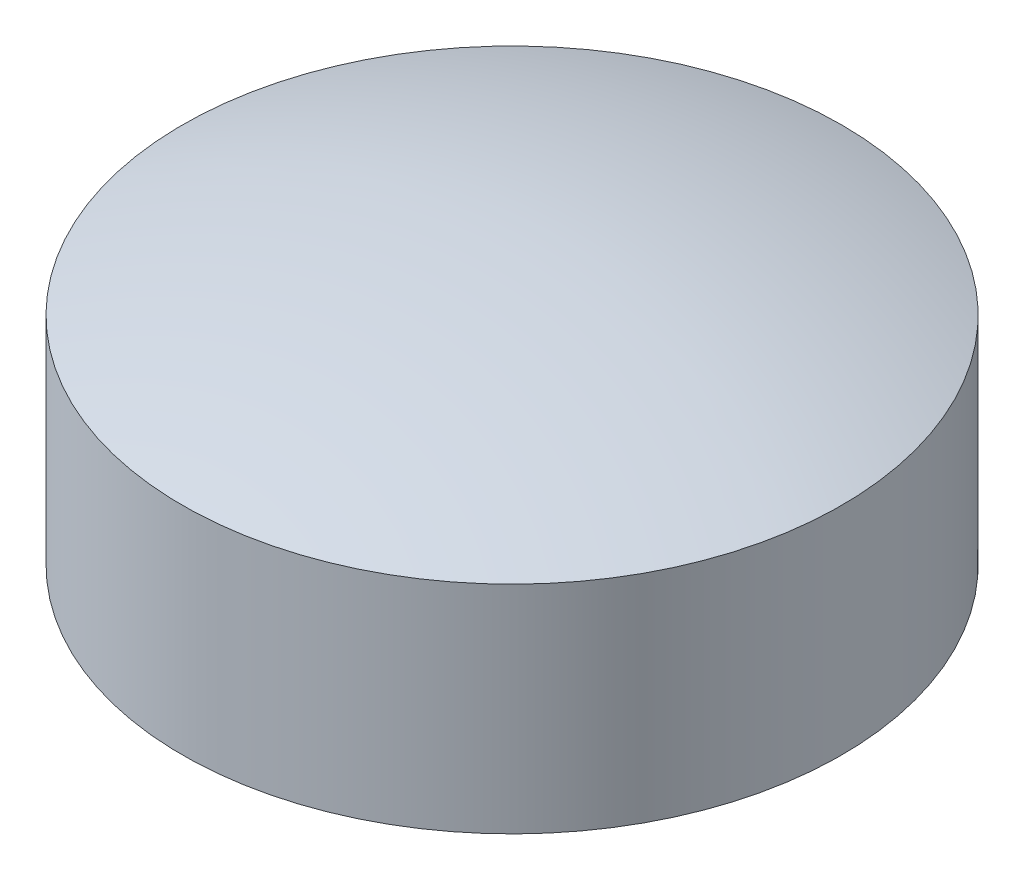
ISO-10303-21;
HEADER;
FILE_DESCRIPTION(('STEP AP214'),'2;1');
FILE_NAME('part.step','',(''),(''),'','','');
FILE_SCHEMA(('AUTOMOTIVE_DESIGN { 1 0 10303 214 1 1 1 1 }'));
ENDSEC;
DATA;
#1=APPLICATION_CONTEXT('core data for automotive mechanical design processes');
#2=APPLICATION_PROTOCOL_DEFINITION('international standard','automotive_design',2000,#1);
#3=PRODUCT_CONTEXT('',#1,'mechanical');
#4=PRODUCT('Part','Part','',(#3));
#5=PRODUCT_RELATED_PRODUCT_CATEGORY('part','',(#4));
#6=PRODUCT_DEFINITION_FORMATION('','',#4);
#7=PRODUCT_DEFINITION_CONTEXT('part definition',#1,'design');
#8=PRODUCT_DEFINITION('design','',#6,#7);
#9=PRODUCT_DEFINITION_SHAPE('','',#8);
#10=(LENGTH_UNIT() NAMED_UNIT(*) SI_UNIT(.MILLI.,.METRE.));
#11=(NAMED_UNIT(*) PLANE_ANGLE_UNIT() SI_UNIT($,.RADIAN.));
#12=(NAMED_UNIT(*) SI_UNIT($,.STERADIAN.) SOLID_ANGLE_UNIT());
#13=UNCERTAINTY_MEASURE_WITH_UNIT(LENGTH_MEASURE(1.E-05),#10,'distance_accuracy_value','');
#14=(GEOMETRIC_REPRESENTATION_CONTEXT(3) GLOBAL_UNCERTAINTY_ASSIGNED_CONTEXT((#13)) GLOBAL_UNIT_ASSIGNED_CONTEXT((#10,
#11,#12)) REPRESENTATION_CONTEXT('',''));
#15=CARTESIAN_POINT('',(0.,0.,0.));
#16=DIRECTION('',(0.,0.,1.));
#17=DIRECTION('',(1.,0.,0.));
#18=AXIS2_PLACEMENT_3D('',#15,#16,#17);
#19=CARTESIAN_POINT('',(4.83169060316868E-13,5655.35451552389,-699.260009999996));
#20=DIRECTION('',(0.,0.,-1.));
#21=DIRECTION('',(0.,-1.,0.));
#22=AXIS2_PLACEMENT_3D('',#19,#20,#21);
#23=SPHERICAL_SURFACE('',#22,173.546260270407);
#24=CARTESIAN_POINT('',(-1.27897692436818E-13,5496.55179371522,-699.260009999996));
#25=DIRECTION('',(0.,-1.,0.));
#26=DIRECTION('',(0.,0.,-1.));
#27=AXIS2_PLACEMENT_3D('',#24,#25,#26);
#28=CIRCLE('',#27,70.);
#29=CARTESIAN_POINT('',(-1.27897692436818E-13,5496.55179371522,-769.260009999996));
#30=VERTEX_POINT('',#29);
#31=EDGE_CURVE('E19',#30,#30,#28,.F.);
#32=ORIENTED_EDGE('',*,*,#31,.F.);
#33=EDGE_LOOP('',(#32));
#34=FACE_BOUND('',#33,.T.);
#35=ADVANCED_FACE('F15',(#34),#23,.T.);
#36=CARTESIAN_POINT('',(-3.12638803734444E-13,5349.86428529444,-699.260009999996));
#37=DIRECTION('',(0.,0.,-1.));
#38=DIRECTION('',(0.,1.,0.));
#39=AXIS2_PLACEMENT_3D('',#36,#37,#38);
#40=SPHERICAL_SURFACE('',#39,204.947990059204);
#41=CARTESIAN_POINT('',(-1.27897692436818E-13,5542.4874371462,-699.260009999996));
#42=DIRECTION('',(0.,-1.,0.));
#43=DIRECTION('',(0.,0.,-1.));
#44=AXIS2_PLACEMENT_3D('',#41,#42,#43);
#45=CIRCLE('',#44,70.);
#46=CARTESIAN_POINT('',(-1.27897692436818E-13,5542.4874371462,-769.260009999996));
#47=VERTEX_POINT('',#46);
#48=EDGE_CURVE('E10',#47,#47,#45,.T.);
#49=ORIENTED_EDGE('',*,*,#48,.F.);
#50=EDGE_LOOP('',(#49));
#51=FACE_BOUND('',#50,.T.);
#52=ADVANCED_FACE('F30',(#51),#40,.T.);
#53=CARTESIAN_POINT('',(-1.27897692436818E-13,5542.4874371462,-699.260009999996));
#54=DIRECTION('',(0.,-1.,0.));
#55=DIRECTION('',(0.,0.,-1.));
#56=AXIS2_PLACEMENT_3D('',#53,#54,#55);
#57=CYLINDRICAL_SURFACE('',#56,70.);
#58=ORIENTED_EDGE('',*,*,#48,.T.);
#59=EDGE_LOOP('',(#58));
#60=FACE_BOUND('',#59,.T.);
#61=ORIENTED_EDGE('',*,*,#31,.T.);
#62=EDGE_LOOP('',(#61));
#63=FACE_BOUND('',#62,.T.);
#64=ADVANCED_FACE('F17',(#60,#63),#57,.T.);
#65=CLOSED_SHELL('',(#35,#52,#64));
#66=MANIFOLD_SOLID_BREP('B1',#65);
#67=ADVANCED_BREP_SHAPE_REPRESENTATION('',(#18,#66),#14);
#68=SHAPE_DEFINITION_REPRESENTATION(#9,#67);
ENDSEC;
END-ISO-10303-21;
